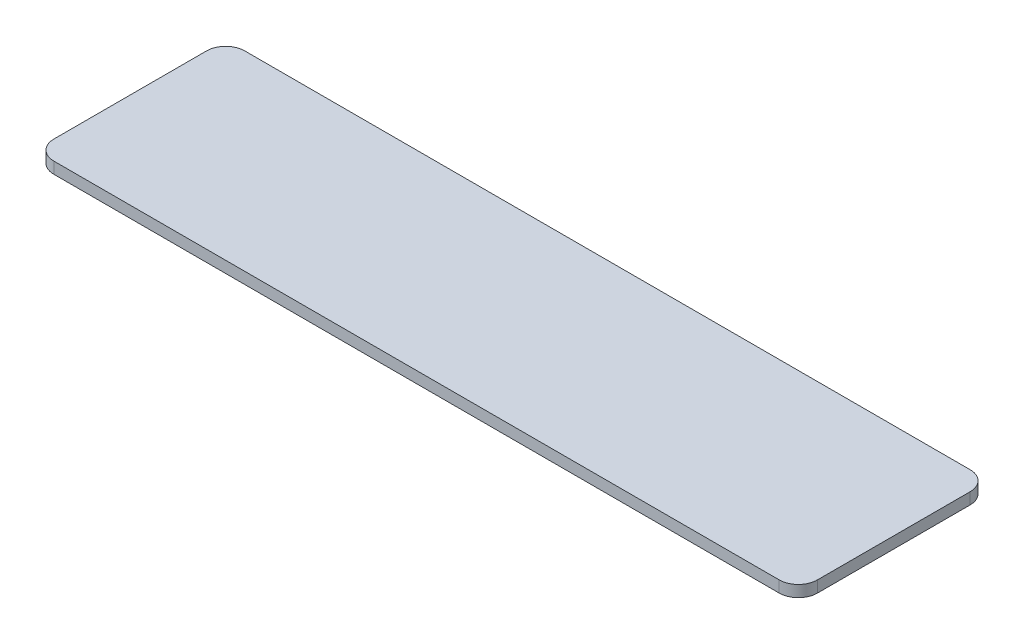
ISO-10303-21;
HEADER;
FILE_DESCRIPTION(('STEP AP214'),'2;1');
FILE_NAME('part.step','',(''),(''),'','','');
FILE_SCHEMA(('AUTOMOTIVE_DESIGN { 1 0 10303 214 1 1 1 1 }'));
ENDSEC;
DATA;
#1=APPLICATION_CONTEXT('core data for automotive mechanical design processes');
#2=APPLICATION_PROTOCOL_DEFINITION('international standard','automotive_design',2000,#1);
#3=PRODUCT_CONTEXT('',#1,'mechanical');
#4=PRODUCT('Part','Part','',(#3));
#5=PRODUCT_RELATED_PRODUCT_CATEGORY('part','',(#4));
#6=PRODUCT_DEFINITION_FORMATION('','',#4);
#7=PRODUCT_DEFINITION_CONTEXT('part definition',#1,'design');
#8=PRODUCT_DEFINITION('design','',#6,#7);
#9=PRODUCT_DEFINITION_SHAPE('','',#8);
#10=(LENGTH_UNIT() NAMED_UNIT(*) SI_UNIT(.MILLI.,.METRE.));
#11=(NAMED_UNIT(*) PLANE_ANGLE_UNIT() SI_UNIT($,.RADIAN.));
#12=(NAMED_UNIT(*) SI_UNIT($,.STERADIAN.) SOLID_ANGLE_UNIT());
#13=UNCERTAINTY_MEASURE_WITH_UNIT(LENGTH_MEASURE(1.E-05),#10,'distance_accuracy_value','');
#14=(GEOMETRIC_REPRESENTATION_CONTEXT(3) GLOBAL_UNCERTAINTY_ASSIGNED_CONTEXT((#13)) GLOBAL_UNIT_ASSIGNED_CONTEXT((#10,
#11,#12)) REPRESENTATION_CONTEXT('',''));
#15=CARTESIAN_POINT('',(0.,0.,0.));
#16=DIRECTION('',(0.,0.,1.));
#17=DIRECTION('',(1.,0.,0.));
#18=AXIS2_PLACEMENT_3D('',#15,#16,#17);
#19=CARTESIAN_POINT('',(100.,3.,25.));
#20=DIRECTION('',(-1.,0.,0.));
#21=DIRECTION('',(0.,0.,1.));
#22=AXIS2_PLACEMENT_3D('',#19,#20,#21);
#23=PLANE('',#22);
#24=DIRECTION('',(0.,0.,-1.));
#25=VECTOR('',#24,1.);
#26=CARTESIAN_POINT('',(100.,0.,25.));
#27=LINE('',#26,#25);
#28=CARTESIAN_POINT('',(100.,0.,20.));
#29=VERTEX_POINT('',#28);
#30=CARTESIAN_POINT('',(100.,0.,-20.));
#31=VERTEX_POINT('',#30);
#32=EDGE_CURVE('E157',#29,#31,#27,.T.);
#33=ORIENTED_EDGE('',*,*,#32,.T.);
#34=DIRECTION('',(0.,-1.,0.));
#35=VECTOR('',#34,1.);
#36=CARTESIAN_POINT('',(100.,3.,-20.));
#37=LINE('',#36,#35);
#38=CARTESIAN_POINT('',(100.,3.,-20.));
#39=VERTEX_POINT('',#38);
#40=EDGE_CURVE('E11',#31,#39,#37,.F.);
#41=ORIENTED_EDGE('',*,*,#40,.T.);
#42=DIRECTION('',(0.,0.,-1.));
#43=VECTOR('',#42,1.);
#44=CARTESIAN_POINT('',(100.,3.,25.));
#45=LINE('',#44,#43);
#46=CARTESIAN_POINT('',(100.,3.,20.));
#47=VERTEX_POINT('',#46);
#48=EDGE_CURVE('E125',#47,#39,#45,.T.);
#49=ORIENTED_EDGE('',*,*,#48,.F.);
#50=DIRECTION('',(0.,-1.,0.));
#51=VECTOR('',#50,1.);
#52=CARTESIAN_POINT('',(100.,3.,20.));
#53=LINE('',#52,#51);
#54=EDGE_CURVE('E41',#47,#29,#53,.T.);
#55=ORIENTED_EDGE('',*,*,#54,.T.);
#56=EDGE_LOOP('',(#33,#41,#49,#55));
#57=FACE_BOUND('',#56,.T.);
#58=ADVANCED_FACE('F33',(#57),#23,.F.);
#59=CARTESIAN_POINT('',(-100.,3.,-25.));
#60=DIRECTION('',(0.,0.,1.));
#61=DIRECTION('',(1.,0.,0.));
#62=AXIS2_PLACEMENT_3D('',#59,#60,#61);
#63=PLANE('',#62);
#64=DIRECTION('',(-1.,0.,0.));
#65=VECTOR('',#64,1.);
#66=CARTESIAN_POINT('',(-100.,0.,-25.));
#67=LINE('',#66,#65);
#68=CARTESIAN_POINT('',(95.,0.,-25.));
#69=VERTEX_POINT('',#68);
#70=CARTESIAN_POINT('',(-95.,0.,-25.));
#71=VERTEX_POINT('',#70);
#72=EDGE_CURVE('E130',#69,#71,#67,.T.);
#73=ORIENTED_EDGE('',*,*,#72,.T.);
#74=DIRECTION('',(0.,-1.,0.));
#75=VECTOR('',#74,1.);
#76=CARTESIAN_POINT('',(-95.,3.,-25.));
#77=LINE('',#76,#75);
#78=CARTESIAN_POINT('',(-95.,3.,-25.));
#79=VERTEX_POINT('',#78);
#80=EDGE_CURVE('E48',#71,#79,#77,.F.);
#81=ORIENTED_EDGE('',*,*,#80,.T.);
#82=DIRECTION('',(-1.,0.,0.));
#83=VECTOR('',#82,1.);
#84=CARTESIAN_POINT('',(-100.,3.,-25.));
#85=LINE('',#84,#83);
#86=CARTESIAN_POINT('',(95.,3.,-25.));
#87=VERTEX_POINT('',#86);
#88=EDGE_CURVE('E128',#87,#79,#85,.T.);
#89=ORIENTED_EDGE('',*,*,#88,.F.);
#90=DIRECTION('',(0.,-1.,0.));
#91=VECTOR('',#90,1.);
#92=CARTESIAN_POINT('',(95.,3.,-25.));
#93=LINE('',#92,#91);
#94=EDGE_CURVE('E149',#87,#69,#93,.T.);
#95=ORIENTED_EDGE('',*,*,#94,.T.);
#96=EDGE_LOOP('',(#73,#81,#89,#95));
#97=FACE_BOUND('',#96,.T.);
#98=ADVANCED_FACE('F177',(#97),#63,.F.);
#99=CARTESIAN_POINT('',(-100.,3.,25.));
#100=DIRECTION('',(1.,0.,0.));
#101=DIRECTION('',(0.,0.,-1.));
#102=AXIS2_PLACEMENT_3D('',#99,#100,#101);
#103=PLANE('',#102);
#104=DIRECTION('',(0.,0.,1.));
#105=VECTOR('',#104,1.);
#106=CARTESIAN_POINT('',(-100.,0.,25.));
#107=LINE('',#106,#105);
#108=CARTESIAN_POINT('',(-100.,0.,-20.));
#109=VERTEX_POINT('',#108);
#110=CARTESIAN_POINT('',(-100.,0.,20.));
#111=VERTEX_POINT('',#110);
#112=EDGE_CURVE('E126',#109,#111,#107,.T.);
#113=ORIENTED_EDGE('',*,*,#112,.T.);
#114=DIRECTION('',(0.,-1.,0.));
#115=VECTOR('',#114,1.);
#116=CARTESIAN_POINT('',(-100.,3.,20.));
#117=LINE('',#116,#115);
#118=CARTESIAN_POINT('',(-100.,3.,20.));
#119=VERTEX_POINT('',#118);
#120=EDGE_CURVE('E104',#111,#119,#117,.F.);
#121=ORIENTED_EDGE('',*,*,#120,.T.);
#122=DIRECTION('',(0.,0.,1.));
#123=VECTOR('',#122,1.);
#124=CARTESIAN_POINT('',(-100.,3.,25.));
#125=LINE('',#124,#123);
#126=CARTESIAN_POINT('',(-100.,3.,-20.));
#127=VERTEX_POINT('',#126);
#128=EDGE_CURVE('E165',#127,#119,#125,.T.);
#129=ORIENTED_EDGE('',*,*,#128,.F.);
#130=DIRECTION('',(0.,-1.,0.));
#131=VECTOR('',#130,1.);
#132=CARTESIAN_POINT('',(-100.,3.,-20.));
#133=LINE('',#132,#131);
#134=EDGE_CURVE('E109',#127,#109,#133,.T.);
#135=ORIENTED_EDGE('',*,*,#134,.T.);
#136=EDGE_LOOP('',(#113,#121,#129,#135));
#137=FACE_BOUND('',#136,.T.);
#138=ADVANCED_FACE('F176',(#137),#103,.F.);
#139=CARTESIAN_POINT('',(-100.,3.,25.));
#140=DIRECTION('',(0.,0.,-1.));
#141=DIRECTION('',(-1.,0.,0.));
#142=AXIS2_PLACEMENT_3D('',#139,#140,#141);
#143=PLANE('',#142);
#144=DIRECTION('',(1.,0.,0.));
#145=VECTOR('',#144,1.);
#146=CARTESIAN_POINT('',(-100.,3.,25.));
#147=LINE('',#146,#145);
#148=CARTESIAN_POINT('',(-95.,3.,25.));
#149=VERTEX_POINT('',#148);
#150=CARTESIAN_POINT('',(95.,3.,25.));
#151=VERTEX_POINT('',#150);
#152=EDGE_CURVE('E119',#149,#151,#147,.T.);
#153=ORIENTED_EDGE('',*,*,#152,.F.);
#154=DIRECTION('',(0.,-1.,0.));
#155=VECTOR('',#154,1.);
#156=CARTESIAN_POINT('',(-95.,3.,25.));
#157=LINE('',#156,#155);
#158=CARTESIAN_POINT('',(-95.,0.,25.));
#159=VERTEX_POINT('',#158);
#160=EDGE_CURVE('E103',#149,#159,#157,.T.);
#161=ORIENTED_EDGE('',*,*,#160,.T.);
#162=DIRECTION('',(1.,0.,0.));
#163=VECTOR('',#162,1.);
#164=CARTESIAN_POINT('',(-100.,0.,25.));
#165=LINE('',#164,#163);
#166=CARTESIAN_POINT('',(95.,0.,25.));
#167=VERTEX_POINT('',#166);
#168=EDGE_CURVE('E116',#159,#167,#165,.T.);
#169=ORIENTED_EDGE('',*,*,#168,.T.);
#170=DIRECTION('',(0.,-1.,0.));
#171=VECTOR('',#170,1.);
#172=CARTESIAN_POINT('',(95.,3.,25.));
#173=LINE('',#172,#171);
#174=EDGE_CURVE('E121',#167,#151,#173,.F.);
#175=ORIENTED_EDGE('',*,*,#174,.T.);
#176=EDGE_LOOP('',(#153,#161,#169,#175));
#177=FACE_BOUND('',#176,.T.);
#178=ADVANCED_FACE('F115',(#177),#143,.F.);
#179=CARTESIAN_POINT('',(0.,3.,0.));
#180=DIRECTION('',(0.,-1.,0.));
#181=DIRECTION('',(0.,0.,-1.));
#182=AXIS2_PLACEMENT_3D('',#179,#180,#181);
#183=PLANE('',#182);
#184=ORIENTED_EDGE('',*,*,#128,.T.);
#185=CARTESIAN_POINT('',(-95.,3.,20.));
#186=DIRECTION('',(0.,-1.,0.));
#187=DIRECTION('',(0.,0.,-1.));
#188=AXIS2_PLACEMENT_3D('',#185,#186,#187);
#189=CIRCLE('',#188,5.);
#190=EDGE_CURVE('E147',#119,#149,#189,.F.);
#191=ORIENTED_EDGE('',*,*,#190,.T.);
#192=ORIENTED_EDGE('',*,*,#152,.T.);
#193=CARTESIAN_POINT('',(95.,3.,20.));
#194=DIRECTION('',(0.,-1.,0.));
#195=DIRECTION('',(0.,0.,-1.));
#196=AXIS2_PLACEMENT_3D('',#193,#194,#195);
#197=CIRCLE('',#196,5.);
#198=EDGE_CURVE('E142',#151,#47,#197,.F.);
#199=ORIENTED_EDGE('',*,*,#198,.T.);
#200=ORIENTED_EDGE('',*,*,#48,.T.);
#201=CARTESIAN_POINT('',(95.,3.,-20.));
#202=DIRECTION('',(0.,-1.,0.));
#203=DIRECTION('',(0.,0.,-1.));
#204=AXIS2_PLACEMENT_3D('',#201,#202,#203);
#205=CIRCLE('',#204,5.);
#206=EDGE_CURVE('E55',#39,#87,#205,.F.);
#207=ORIENTED_EDGE('',*,*,#206,.T.);
#208=ORIENTED_EDGE('',*,*,#88,.T.);
#209=CARTESIAN_POINT('',(-95.,3.,-20.));
#210=DIRECTION('',(0.,-1.,0.));
#211=DIRECTION('',(0.,0.,-1.));
#212=AXIS2_PLACEMENT_3D('',#209,#210,#211);
#213=CIRCLE('',#212,5.);
#214=EDGE_CURVE('E145',#79,#127,#213,.F.);
#215=ORIENTED_EDGE('',*,*,#214,.T.);
#216=EDGE_LOOP('',(#184,#191,#192,#199,#200,#207,#208,#215));
#217=FACE_BOUND('',#216,.T.);
#218=ADVANCED_FACE('F169',(#217),#183,.F.);
#219=CARTESIAN_POINT('',(0.,0.,0.));
#220=DIRECTION('',(0.,-1.,0.));
#221=DIRECTION('',(0.,0.,-1.));
#222=AXIS2_PLACEMENT_3D('',#219,#220,#221);
#223=PLANE('',#222);
#224=ORIENTED_EDGE('',*,*,#168,.F.);
#225=CARTESIAN_POINT('',(-95.,0.,20.));
#226=DIRECTION('',(0.,-1.,0.));
#227=DIRECTION('',(0.,0.,-1.));
#228=AXIS2_PLACEMENT_3D('',#225,#226,#227);
#229=CIRCLE('',#228,5.);
#230=EDGE_CURVE('E99',#159,#111,#229,.T.);
#231=ORIENTED_EDGE('',*,*,#230,.T.);
#232=ORIENTED_EDGE('',*,*,#112,.F.);
#233=CARTESIAN_POINT('',(-95.,0.,-20.));
#234=DIRECTION('',(0.,-1.,0.));
#235=DIRECTION('',(0.,0.,-1.));
#236=AXIS2_PLACEMENT_3D('',#233,#234,#235);
#237=CIRCLE('',#236,5.);
#238=EDGE_CURVE('E110',#109,#71,#237,.T.);
#239=ORIENTED_EDGE('',*,*,#238,.T.);
#240=ORIENTED_EDGE('',*,*,#72,.F.);
#241=CARTESIAN_POINT('',(95.,0.,-20.));
#242=DIRECTION('',(0.,-1.,0.));
#243=DIRECTION('',(0.,0.,-1.));
#244=AXIS2_PLACEMENT_3D('',#241,#242,#243);
#245=CIRCLE('',#244,5.);
#246=EDGE_CURVE('E136',#69,#31,#245,.T.);
#247=ORIENTED_EDGE('',*,*,#246,.T.);
#248=ORIENTED_EDGE('',*,*,#32,.F.);
#249=CARTESIAN_POINT('',(95.,0.,20.));
#250=DIRECTION('',(0.,-1.,0.));
#251=DIRECTION('',(0.,0.,-1.));
#252=AXIS2_PLACEMENT_3D('',#249,#250,#251);
#253=CIRCLE('',#252,5.);
#254=EDGE_CURVE('E120',#29,#167,#253,.T.);
#255=ORIENTED_EDGE('',*,*,#254,.T.);
#256=EDGE_LOOP('',(#224,#231,#232,#239,#240,#247,#248,#255));
#257=FACE_BOUND('',#256,.T.);
#258=ADVANCED_FACE('F123',(#257),#223,.T.);
#259=CARTESIAN_POINT('',(-95.,3.,20.));
#260=DIRECTION('',(0.,-1.,0.));
#261=DIRECTION('',(0.,0.,-1.));
#262=AXIS2_PLACEMENT_3D('',#259,#260,#261);
#263=CYLINDRICAL_SURFACE('',#262,5.);
#264=ORIENTED_EDGE('',*,*,#190,.F.);
#265=ORIENTED_EDGE('',*,*,#120,.F.);
#266=ORIENTED_EDGE('',*,*,#230,.F.);
#267=ORIENTED_EDGE('',*,*,#160,.F.);
#268=EDGE_LOOP('',(#264,#265,#266,#267));
#269=FACE_BOUND('',#268,.T.);
#270=ADVANCED_FACE('F102',(#269),#263,.T.);
#271=CARTESIAN_POINT('',(-95.,3.,-20.));
#272=DIRECTION('',(0.,-1.,0.));
#273=DIRECTION('',(0.,0.,-1.));
#274=AXIS2_PLACEMENT_3D('',#271,#272,#273);
#275=CYLINDRICAL_SURFACE('',#274,5.);
#276=ORIENTED_EDGE('',*,*,#214,.F.);
#277=ORIENTED_EDGE('',*,*,#80,.F.);
#278=ORIENTED_EDGE('',*,*,#238,.F.);
#279=ORIENTED_EDGE('',*,*,#134,.F.);
#280=EDGE_LOOP('',(#276,#277,#278,#279));
#281=FACE_BOUND('',#280,.T.);
#282=ADVANCED_FACE('F174',(#281),#275,.T.);
#283=CARTESIAN_POINT('',(95.,3.,-20.));
#284=DIRECTION('',(0.,-1.,0.));
#285=DIRECTION('',(0.,0.,-1.));
#286=AXIS2_PLACEMENT_3D('',#283,#284,#285);
#287=CYLINDRICAL_SURFACE('',#286,5.);
#288=ORIENTED_EDGE('',*,*,#206,.F.);
#289=ORIENTED_EDGE('',*,*,#40,.F.);
#290=ORIENTED_EDGE('',*,*,#246,.F.);
#291=ORIENTED_EDGE('',*,*,#94,.F.);
#292=EDGE_LOOP('',(#288,#289,#290,#291));
#293=FACE_BOUND('',#292,.T.);
#294=ADVANCED_FACE('F179',(#293),#287,.T.);
#295=CARTESIAN_POINT('',(95.,3.,20.));
#296=DIRECTION('',(0.,-1.,0.));
#297=DIRECTION('',(0.,0.,-1.));
#298=AXIS2_PLACEMENT_3D('',#295,#296,#297);
#299=CYLINDRICAL_SURFACE('',#298,5.);
#300=ORIENTED_EDGE('',*,*,#198,.F.);
#301=ORIENTED_EDGE('',*,*,#174,.F.);
#302=ORIENTED_EDGE('',*,*,#254,.F.);
#303=ORIENTED_EDGE('',*,*,#54,.F.);
#304=EDGE_LOOP('',(#300,#301,#302,#303));
#305=FACE_BOUND('',#304,.T.);
#306=ADVANCED_FACE('F35',(#305),#299,.T.);
#307=CLOSED_SHELL('',(#58,#98,#138,#178,#218,#258,#270,#282,#294,#306));
#308=MANIFOLD_SOLID_BREP('B2',#307);
#309=ADVANCED_BREP_SHAPE_REPRESENTATION('',(#18,#308),#14);
#310=SHAPE_DEFINITION_REPRESENTATION(#9,#309);
ENDSEC;
END-ISO-10303-21;
